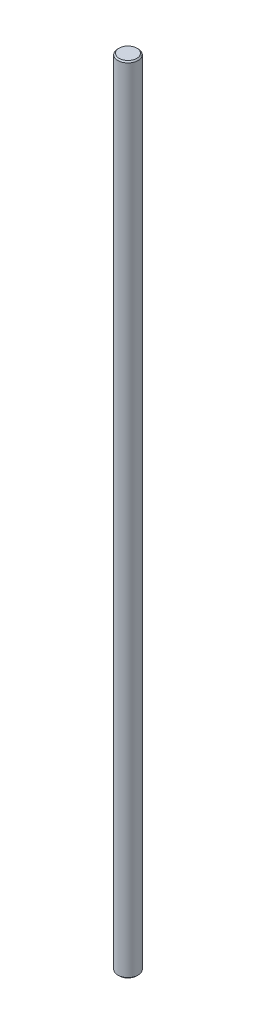
ISO-10303-21;
HEADER;
FILE_DESCRIPTION(('STEP AP214'),'2;1');
FILE_NAME('part.step','',(''),(''),'','','');
FILE_SCHEMA(('AUTOMOTIVE_DESIGN { 1 0 10303 214 1 1 1 1 }'));
ENDSEC;
DATA;
#1=APPLICATION_CONTEXT('core data for automotive mechanical design processes');
#2=APPLICATION_PROTOCOL_DEFINITION('international standard','automotive_design',2000,#1);
#3=PRODUCT_CONTEXT('',#1,'mechanical');
#4=PRODUCT('Part','Part','',(#3));
#5=PRODUCT_RELATED_PRODUCT_CATEGORY('part','',(#4));
#6=PRODUCT_DEFINITION_FORMATION('','',#4);
#7=PRODUCT_DEFINITION_CONTEXT('part definition',#1,'design');
#8=PRODUCT_DEFINITION('design','',#6,#7);
#9=PRODUCT_DEFINITION_SHAPE('','',#8);
#10=(LENGTH_UNIT() NAMED_UNIT(*) SI_UNIT(.MILLI.,.METRE.));
#11=(NAMED_UNIT(*) PLANE_ANGLE_UNIT() SI_UNIT($,.RADIAN.));
#12=(NAMED_UNIT(*) SI_UNIT($,.STERADIAN.) SOLID_ANGLE_UNIT());
#13=UNCERTAINTY_MEASURE_WITH_UNIT(LENGTH_MEASURE(1.E-05),#10,'distance_accuracy_value','');
#14=(GEOMETRIC_REPRESENTATION_CONTEXT(3) GLOBAL_UNCERTAINTY_ASSIGNED_CONTEXT((#13)) GLOBAL_UNIT_ASSIGNED_CONTEXT((#10,
#11,#12)) REPRESENTATION_CONTEXT('',''));
#15=CARTESIAN_POINT('',(0.,0.,0.));
#16=DIRECTION('',(0.,0.,1.));
#17=DIRECTION('',(1.,0.,0.));
#18=AXIS2_PLACEMENT_3D('',#15,#16,#17);
#19=CARTESIAN_POINT('',(0.,157.,0.));
#20=DIRECTION('',(0.,-1.,0.));
#21=DIRECTION('',(0.,0.,-1.));
#22=AXIS2_PLACEMENT_3D('',#19,#20,#21);
#23=CYLINDRICAL_SURFACE('',#22,4.);
#24=CARTESIAN_POINT('',(0.,-156.5,0.));
#25=DIRECTION('',(0.,1.,0.));
#26=DIRECTION('',(0.,0.,1.));
#27=AXIS2_PLACEMENT_3D('',#24,#25,#26);
#28=CIRCLE('',#27,4.);
#29=CARTESIAN_POINT('',(0.,-156.5,4.));
#30=VERTEX_POINT('',#29);
#31=EDGE_CURVE('E45',#30,#30,#28,.T.);
#32=ORIENTED_EDGE('',*,*,#31,.T.);
#33=EDGE_LOOP('',(#32));
#34=FACE_BOUND('',#33,.T.);
#35=CARTESIAN_POINT('',(0.,156.5,0.));
#36=DIRECTION('',(0.,1.,0.));
#37=DIRECTION('',(0.,0.,1.));
#38=AXIS2_PLACEMENT_3D('',#35,#36,#37);
#39=CIRCLE('',#38,4.);
#40=CARTESIAN_POINT('',(0.,156.5,4.));
#41=VERTEX_POINT('',#40);
#42=EDGE_CURVE('E49',#41,#41,#39,.F.);
#43=ORIENTED_EDGE('',*,*,#42,.T.);
#44=EDGE_LOOP('',(#43));
#45=FACE_BOUND('',#44,.T.);
#46=ADVANCED_FACE('F33',(#34,#45),#23,.T.);
#47=CARTESIAN_POINT('',(0.,157.,0.));
#48=DIRECTION('',(0.,1.,0.));
#49=DIRECTION('',(0.,0.,1.));
#50=AXIS2_PLACEMENT_3D('',#47,#48,#49);
#51=PLANE('',#50);
#52=CARTESIAN_POINT('',(0.,157.,0.));
#53=DIRECTION('',(0.,1.,0.));
#54=DIRECTION('',(0.,0.,1.));
#55=AXIS2_PLACEMENT_3D('',#52,#53,#54);
#56=CIRCLE('',#55,3.49999999999992);
#57=CARTESIAN_POINT('',(0.,157.,3.49999999999992));
#58=VERTEX_POINT('',#57);
#59=EDGE_CURVE('E10',#58,#58,#56,.T.);
#60=ORIENTED_EDGE('',*,*,#59,.T.);
#61=EDGE_LOOP('',(#60));
#62=FACE_BOUND('',#61,.T.);
#63=ADVANCED_FACE('F65',(#62),#51,.T.);
#64=CARTESIAN_POINT('',(0.,-157.,0.));
#65=DIRECTION('',(0.,1.,0.));
#66=DIRECTION('',(0.,0.,1.));
#67=AXIS2_PLACEMENT_3D('',#64,#65,#66);
#68=PLANE('',#67);
#69=CARTESIAN_POINT('',(0.,-157.,0.));
#70=DIRECTION('',(0.,1.,0.));
#71=DIRECTION('',(0.,0.,1.));
#72=AXIS2_PLACEMENT_3D('',#69,#70,#71);
#73=CIRCLE('',#72,3.50000000000006);
#74=CARTESIAN_POINT('',(0.,-157.,3.50000000000006));
#75=VERTEX_POINT('',#74);
#76=EDGE_CURVE('E41',#75,#75,#73,.F.);
#77=ORIENTED_EDGE('',*,*,#76,.T.);
#78=EDGE_LOOP('',(#77));
#79=FACE_BOUND('',#78,.T.);
#80=ADVANCED_FACE('F62',(#79),#68,.F.);
#81=CARTESIAN_POINT('',(0.,-156.5,0.));
#82=DIRECTION('',(0.,1.,0.));
#83=DIRECTION('',(0.,0.,1.));
#84=AXIS2_PLACEMENT_3D('',#81,#82,#83);
#85=CONICAL_SURFACE('',#84,4.,0.785398163397389);
#86=ORIENTED_EDGE('',*,*,#76,.F.);
#87=EDGE_LOOP('',(#86));
#88=FACE_BOUND('',#87,.T.);
#89=ORIENTED_EDGE('',*,*,#31,.F.);
#90=EDGE_LOOP('',(#89));
#91=FACE_BOUND('',#90,.T.);
#92=ADVANCED_FACE('F58',(#88,#91),#85,.T.);
#93=CARTESIAN_POINT('',(0.,157.,0.));
#94=DIRECTION('',(0.,-1.,0.));
#95=DIRECTION('',(0.,0.,-1.));
#96=AXIS2_PLACEMENT_3D('',#93,#94,#95);
#97=CONICAL_SURFACE('',#96,3.49999999999992,0.785398163397445);
#98=ORIENTED_EDGE('',*,*,#42,.F.);
#99=EDGE_LOOP('',(#98));
#100=FACE_BOUND('',#99,.T.);
#101=ORIENTED_EDGE('',*,*,#59,.F.);
#102=EDGE_LOOP('',(#101));
#103=FACE_BOUND('',#102,.T.);
#104=ADVANCED_FACE('F36',(#100,#103),#97,.T.);
#105=CLOSED_SHELL('',(#46,#63,#80,#92,#104));
#106=MANIFOLD_SOLID_BREP('B2',#105);
#107=ADVANCED_BREP_SHAPE_REPRESENTATION('',(#18,#106),#14);
#108=SHAPE_DEFINITION_REPRESENTATION(#9,#107);
ENDSEC;
END-ISO-10303-21;
